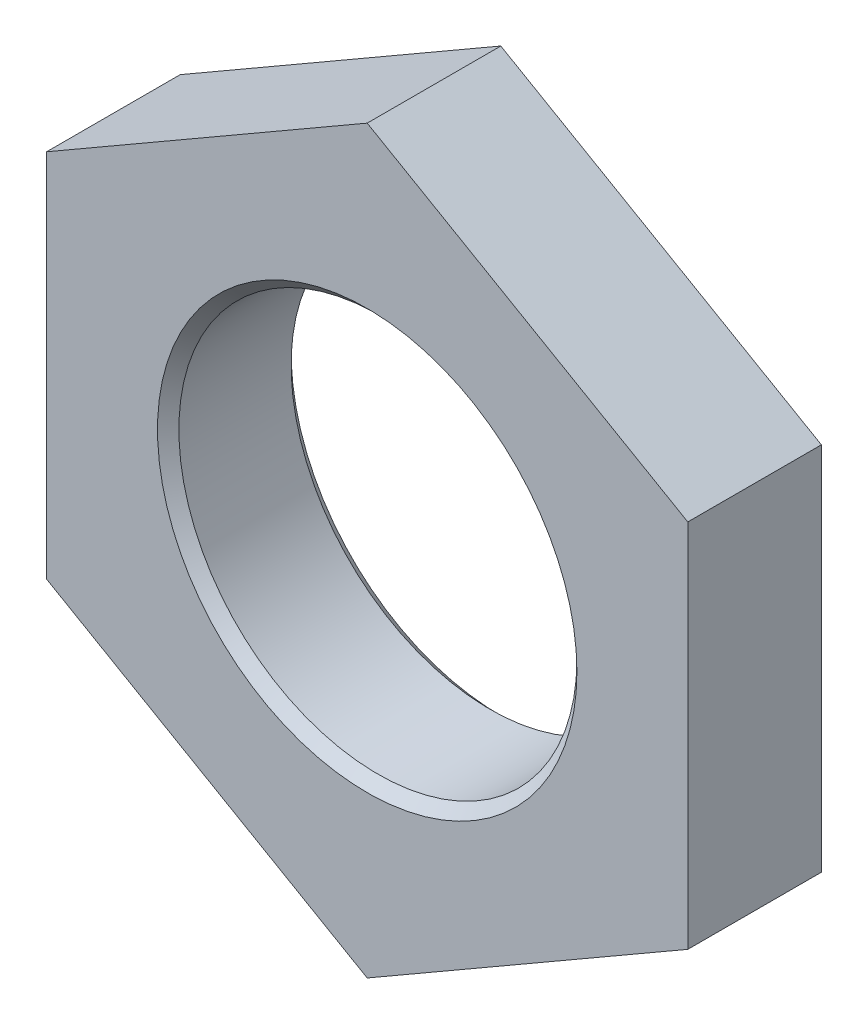
ISO-10303-21;
HEADER;
FILE_DESCRIPTION(('STEP AP214'),'2;1');
FILE_NAME('part.step','',(''),(''),'','','');
FILE_SCHEMA(('AUTOMOTIVE_DESIGN { 1 0 10303 214 1 1 1 1 }'));
ENDSEC;
DATA;
#1=APPLICATION_CONTEXT('core data for automotive mechanical design processes');
#2=APPLICATION_PROTOCOL_DEFINITION('international standard','automotive_design',2000,#1);
#3=PRODUCT_CONTEXT('',#1,'mechanical');
#4=PRODUCT('Part','Part','',(#3));
#5=PRODUCT_RELATED_PRODUCT_CATEGORY('part','',(#4));
#6=PRODUCT_DEFINITION_FORMATION('','',#4);
#7=PRODUCT_DEFINITION_CONTEXT('part definition',#1,'design');
#8=PRODUCT_DEFINITION('design','',#6,#7);
#9=PRODUCT_DEFINITION_SHAPE('','',#8);
#10=(LENGTH_UNIT() NAMED_UNIT(*) SI_UNIT(.MILLI.,.METRE.));
#11=(NAMED_UNIT(*) PLANE_ANGLE_UNIT() SI_UNIT($,.RADIAN.));
#12=(NAMED_UNIT(*) SI_UNIT($,.STERADIAN.) SOLID_ANGLE_UNIT());
#13=UNCERTAINTY_MEASURE_WITH_UNIT(LENGTH_MEASURE(1.E-05),#10,'distance_accuracy_value','');
#14=(GEOMETRIC_REPRESENTATION_CONTEXT(3) GLOBAL_UNCERTAINTY_ASSIGNED_CONTEXT((#13)) GLOBAL_UNIT_ASSIGNED_CONTEXT((#10,
#11,#12)) REPRESENTATION_CONTEXT('',''));
#15=CARTESIAN_POINT('',(0.,0.,0.));
#16=DIRECTION('',(0.,0.,1.));
#17=DIRECTION('',(1.,0.,0.));
#18=AXIS2_PLACEMENT_3D('',#15,#16,#17);
#19=CARTESIAN_POINT('',(6.,3.46410161513775,2.5));
#20=DIRECTION('',(-0.500000000000001,-0.866025403784438,0.));
#21=DIRECTION('',(0.866025403784438,-0.500000000000001,0.));
#22=AXIS2_PLACEMENT_3D('',#19,#20,#21);
#23=PLANE('',#22);
#24=DIRECTION('',(-0.866025403784438,0.500000000000001,0.));
#25=VECTOR('',#24,1.);
#26=CARTESIAN_POINT('',(6.,3.46410161513775,0.));
#27=LINE('',#26,#25);
#28=CARTESIAN_POINT('',(6.,3.46410161513775,0.));
#29=VERTEX_POINT('',#28);
#30=CARTESIAN_POINT('',(0.,6.92820323027551,0.));
#31=VERTEX_POINT('',#30);
#32=EDGE_CURVE('E134',#29,#31,#27,.T.);
#33=ORIENTED_EDGE('',*,*,#32,.T.);
#34=DIRECTION('',(0.,0.,-1.));
#35=VECTOR('',#34,1.);
#36=CARTESIAN_POINT('',(0.,6.92820323027551,2.5));
#37=LINE('',#36,#35);
#38=CARTESIAN_POINT('',(0.,6.92820323027551,2.5));
#39=VERTEX_POINT('',#38);
#40=EDGE_CURVE('E151',#39,#31,#37,.T.);
#41=ORIENTED_EDGE('',*,*,#40,.F.);
#42=DIRECTION('',(-0.866025403784438,0.500000000000001,0.));
#43=VECTOR('',#42,1.);
#44=CARTESIAN_POINT('',(6.,3.46410161513775,2.5));
#45=LINE('',#44,#43);
#46=CARTESIAN_POINT('',(6.,3.46410161513775,2.5));
#47=VERTEX_POINT('',#46);
#48=EDGE_CURVE('E144',#47,#39,#45,.T.);
#49=ORIENTED_EDGE('',*,*,#48,.F.);
#50=DIRECTION('',(0.,0.,-1.));
#51=VECTOR('',#50,1.);
#52=CARTESIAN_POINT('',(6.,3.46410161513775,2.5));
#53=LINE('',#52,#51);
#54=EDGE_CURVE('E130',#47,#29,#53,.T.);
#55=ORIENTED_EDGE('',*,*,#54,.T.);
#56=EDGE_LOOP('',(#33,#41,#49,#55));
#57=FACE_BOUND('',#56,.T.);
#58=ADVANCED_FACE('F47',(#57),#23,.F.);
#59=CARTESIAN_POINT('',(0.,6.92820323027551,2.5));
#60=DIRECTION('',(0.5,-0.866025403784439,0.));
#61=DIRECTION('',(0.866025403784439,0.5,0.));
#62=AXIS2_PLACEMENT_3D('',#59,#60,#61);
#63=PLANE('',#62);
#64=DIRECTION('',(-0.866025403784439,-0.499999999999999,0.));
#65=VECTOR('',#64,1.);
#66=CARTESIAN_POINT('',(0.,6.92820323027551,0.));
#67=LINE('',#66,#65);
#68=CARTESIAN_POINT('',(-6.,3.46410161513776,0.));
#69=VERTEX_POINT('',#68);
#70=EDGE_CURVE('E137',#31,#69,#67,.T.);
#71=ORIENTED_EDGE('',*,*,#70,.T.);
#72=DIRECTION('',(0.,0.,-1.));
#73=VECTOR('',#72,1.);
#74=CARTESIAN_POINT('',(-6.,3.46410161513776,2.5));
#75=LINE('',#74,#73);
#76=CARTESIAN_POINT('',(-6.,3.46410161513776,2.5));
#77=VERTEX_POINT('',#76);
#78=EDGE_CURVE('E148',#77,#69,#75,.T.);
#79=ORIENTED_EDGE('',*,*,#78,.F.);
#80=DIRECTION('',(-0.866025403784439,-0.499999999999999,0.));
#81=VECTOR('',#80,1.);
#82=CARTESIAN_POINT('',(0.,6.92820323027551,2.5));
#83=LINE('',#82,#81);
#84=EDGE_CURVE('E103',#39,#77,#83,.T.);
#85=ORIENTED_EDGE('',*,*,#84,.F.);
#86=ORIENTED_EDGE('',*,*,#40,.T.);
#87=EDGE_LOOP('',(#71,#79,#85,#86));
#88=FACE_BOUND('',#87,.T.);
#89=ADVANCED_FACE('F180',(#88),#63,.F.);
#90=CARTESIAN_POINT('',(-6.,3.46410161513776,2.5));
#91=DIRECTION('',(1.,0.,0.));
#92=DIRECTION('',(0.,1.,0.));
#93=AXIS2_PLACEMENT_3D('',#90,#91,#92);
#94=PLANE('',#93);
#95=DIRECTION('',(0.,-1.,0.));
#96=VECTOR('',#95,1.);
#97=CARTESIAN_POINT('',(-6.,3.46410161513776,0.));
#98=LINE('',#97,#96);
#99=CARTESIAN_POINT('',(-6.00000000000001,-3.46410161513775,0.));
#100=VERTEX_POINT('',#99);
#101=EDGE_CURVE('E139',#69,#100,#98,.T.);
#102=ORIENTED_EDGE('',*,*,#101,.T.);
#103=DIRECTION('',(0.,0.,-1.));
#104=VECTOR('',#103,1.);
#105=CARTESIAN_POINT('',(-6.00000000000001,-3.46410161513775,2.5));
#106=LINE('',#105,#104);
#107=CARTESIAN_POINT('',(-6.00000000000001,-3.46410161513775,2.5));
#108=VERTEX_POINT('',#107);
#109=EDGE_CURVE('E125',#108,#100,#106,.T.);
#110=ORIENTED_EDGE('',*,*,#109,.F.);
#111=DIRECTION('',(0.,-1.,0.));
#112=VECTOR('',#111,1.);
#113=CARTESIAN_POINT('',(-6.,3.46410161513776,2.5));
#114=LINE('',#113,#112);
#115=EDGE_CURVE('E116',#77,#108,#114,.T.);
#116=ORIENTED_EDGE('',*,*,#115,.F.);
#117=ORIENTED_EDGE('',*,*,#78,.T.);
#118=EDGE_LOOP('',(#102,#110,#116,#117));
#119=FACE_BOUND('',#118,.T.);
#120=ADVANCED_FACE('F186',(#119),#94,.F.);
#121=CARTESIAN_POINT('',(-6.00000000000001,-3.46410161513775,2.5));
#122=DIRECTION('',(0.500000000000001,0.866025403784438,0.));
#123=DIRECTION('',(-0.866025403784438,0.500000000000001,0.));
#124=AXIS2_PLACEMENT_3D('',#121,#122,#123);
#125=PLANE('',#124);
#126=DIRECTION('',(0.866025403784438,-0.500000000000001,0.));
#127=VECTOR('',#126,1.);
#128=CARTESIAN_POINT('',(-6.00000000000001,-3.46410161513775,0.));
#129=LINE('',#128,#127);
#130=CARTESIAN_POINT('',(0.,-6.92820323027551,0.));
#131=VERTEX_POINT('',#130);
#132=EDGE_CURVE('E124',#100,#131,#129,.T.);
#133=ORIENTED_EDGE('',*,*,#132,.T.);
#134=DIRECTION('',(0.,0.,-1.));
#135=VECTOR('',#134,1.);
#136=CARTESIAN_POINT('',(0.,-6.92820323027551,2.5));
#137=LINE('',#136,#135);
#138=CARTESIAN_POINT('',(0.,-6.92820323027551,2.5));
#139=VERTEX_POINT('',#138);
#140=EDGE_CURVE('E121',#139,#131,#137,.T.);
#141=ORIENTED_EDGE('',*,*,#140,.F.);
#142=DIRECTION('',(0.866025403784438,-0.500000000000001,0.));
#143=VECTOR('',#142,1.);
#144=CARTESIAN_POINT('',(-6.00000000000001,-3.46410161513775,2.5));
#145=LINE('',#144,#143);
#146=EDGE_CURVE('E110',#108,#139,#145,.T.);
#147=ORIENTED_EDGE('',*,*,#146,.F.);
#148=ORIENTED_EDGE('',*,*,#109,.T.);
#149=EDGE_LOOP('',(#133,#141,#147,#148));
#150=FACE_BOUND('',#149,.T.);
#151=ADVANCED_FACE('F122',(#150),#125,.F.);
#152=CARTESIAN_POINT('',(0.,-6.92820323027551,2.5));
#153=DIRECTION('',(-0.5,0.866025403784439,0.));
#154=DIRECTION('',(-0.866025403784439,-0.5,0.));
#155=AXIS2_PLACEMENT_3D('',#152,#153,#154);
#156=PLANE('',#155);
#157=DIRECTION('',(0.866025403784439,0.5,0.));
#158=VECTOR('',#157,1.);
#159=CARTESIAN_POINT('',(0.,-6.92820323027551,0.));
#160=LINE('',#159,#158);
#161=CARTESIAN_POINT('',(6.,-3.46410161513777,0.));
#162=VERTEX_POINT('',#161);
#163=EDGE_CURVE('E88',#131,#162,#160,.T.);
#164=ORIENTED_EDGE('',*,*,#163,.T.);
#165=DIRECTION('',(0.,0.,-1.));
#166=VECTOR('',#165,1.);
#167=CARTESIAN_POINT('',(6.,-3.46410161513777,2.5));
#168=LINE('',#167,#166);
#169=CARTESIAN_POINT('',(6.,-3.46410161513777,2.5));
#170=VERTEX_POINT('',#169);
#171=EDGE_CURVE('E126',#170,#162,#168,.T.);
#172=ORIENTED_EDGE('',*,*,#171,.F.);
#173=DIRECTION('',(0.866025403784439,0.5,0.));
#174=VECTOR('',#173,1.);
#175=CARTESIAN_POINT('',(0.,-6.92820323027551,2.5));
#176=LINE('',#175,#174);
#177=EDGE_CURVE('E114',#139,#170,#176,.T.);
#178=ORIENTED_EDGE('',*,*,#177,.F.);
#179=ORIENTED_EDGE('',*,*,#140,.T.);
#180=EDGE_LOOP('',(#164,#172,#178,#179));
#181=FACE_BOUND('',#180,.T.);
#182=ADVANCED_FACE('F128',(#181),#156,.F.);
#183=CARTESIAN_POINT('',(6.,-3.46410161513777,2.5));
#184=DIRECTION('',(-1.,0.,0.));
#185=DIRECTION('',(0.,-1.,0.));
#186=AXIS2_PLACEMENT_3D('',#183,#184,#185);
#187=PLANE('',#186);
#188=DIRECTION('',(0.,1.,0.));
#189=VECTOR('',#188,1.);
#190=CARTESIAN_POINT('',(6.,-3.46410161513777,0.));
#191=LINE('',#190,#189);
#192=EDGE_CURVE('E94',#162,#29,#191,.T.);
#193=ORIENTED_EDGE('',*,*,#192,.T.);
#194=ORIENTED_EDGE('',*,*,#54,.F.);
#195=DIRECTION('',(0.,1.,0.));
#196=VECTOR('',#195,1.);
#197=CARTESIAN_POINT('',(6.,-3.46410161513777,2.5));
#198=LINE('',#197,#196);
#199=EDGE_CURVE('E65',#170,#47,#198,.T.);
#200=ORIENTED_EDGE('',*,*,#199,.F.);
#201=ORIENTED_EDGE('',*,*,#171,.T.);
#202=EDGE_LOOP('',(#193,#194,#200,#201));
#203=FACE_BOUND('',#202,.T.);
#204=ADVANCED_FACE('F201',(#203),#187,.F.);
#205=CARTESIAN_POINT('',(0.,0.,2.5));
#206=DIRECTION('',(0.,0.,1.));
#207=DIRECTION('',(1.,0.,0.));
#208=AXIS2_PLACEMENT_3D('',#205,#206,#207);
#209=PLANE('',#208);
#210=CARTESIAN_POINT('',(0.,0.,2.5));
#211=DIRECTION('',(0.,0.,1.));
#212=DIRECTION('',(1.,0.,0.));
#213=AXIS2_PLACEMENT_3D('',#210,#211,#212);
#214=CIRCLE('',#213,3.92495696314199);
#215=CARTESIAN_POINT('',(3.92495696314199,0.,2.5));
#216=VERTEX_POINT('',#215);
#217=EDGE_CURVE('E57',#216,#216,#214,.F.);
#218=ORIENTED_EDGE('',*,*,#217,.T.);
#219=EDGE_LOOP('',(#218));
#220=FACE_BOUND('',#219,.T.);
#221=ORIENTED_EDGE('',*,*,#48,.T.);
#222=ORIENTED_EDGE('',*,*,#84,.T.);
#223=ORIENTED_EDGE('',*,*,#115,.T.);
#224=ORIENTED_EDGE('',*,*,#146,.T.);
#225=ORIENTED_EDGE('',*,*,#177,.T.);
#226=ORIENTED_EDGE('',*,*,#199,.T.);
#227=EDGE_LOOP('',(#221,#222,#223,#224,#225,#226));
#228=FACE_BOUND('',#227,.T.);
#229=ADVANCED_FACE('F112',(#220,#228),#209,.T.);
#230=CARTESIAN_POINT('',(0.,0.,0.));
#231=DIRECTION('',(0.,0.,1.));
#232=DIRECTION('',(1.,0.,0.));
#233=AXIS2_PLACEMENT_3D('',#230,#231,#232);
#234=PLANE('',#233);
#235=CARTESIAN_POINT('',(0.,0.,0.));
#236=DIRECTION('',(0.,0.,1.));
#237=DIRECTION('',(1.,0.,0.));
#238=AXIS2_PLACEMENT_3D('',#235,#236,#237);
#239=CIRCLE('',#238,3.92495696314198);
#240=CARTESIAN_POINT('',(3.92495696314198,0.,0.));
#241=VERTEX_POINT('',#240);
#242=EDGE_CURVE('E11',#241,#241,#239,.T.);
#243=ORIENTED_EDGE('',*,*,#242,.T.);
#244=EDGE_LOOP('',(#243));
#245=FACE_BOUND('',#244,.T.);
#246=ORIENTED_EDGE('',*,*,#32,.F.);
#247=ORIENTED_EDGE('',*,*,#192,.F.);
#248=ORIENTED_EDGE('',*,*,#163,.F.);
#249=ORIENTED_EDGE('',*,*,#132,.F.);
#250=ORIENTED_EDGE('',*,*,#101,.F.);
#251=ORIENTED_EDGE('',*,*,#70,.F.);
#252=EDGE_LOOP('',(#246,#247,#248,#249,#250,#251));
#253=FACE_BOUND('',#252,.T.);
#254=ADVANCED_FACE('F170',(#245,#253),#234,.F.);
#255=CARTESIAN_POINT('',(0.,0.,6.5));
#256=DIRECTION('',(0.,0.,-1.));
#257=DIRECTION('',(-1.,0.,0.));
#258=AXIS2_PLACEMENT_3D('',#255,#256,#257);
#259=CYLINDRICAL_SURFACE('',#258,3.72495696314199);
#260=CARTESIAN_POINT('',(0.,0.,2.3));
#261=DIRECTION('',(0.,0.,1.));
#262=DIRECTION('',(1.,0.,0.));
#263=AXIS2_PLACEMENT_3D('',#260,#261,#262);
#264=CIRCLE('',#263,3.72495696314199);
#265=CARTESIAN_POINT('',(3.72495696314199,0.,2.3));
#266=VERTEX_POINT('',#265);
#267=EDGE_CURVE('E156',#266,#266,#264,.T.);
#268=ORIENTED_EDGE('',*,*,#267,.T.);
#269=EDGE_LOOP('',(#268));
#270=FACE_BOUND('',#269,.T.);
#271=CARTESIAN_POINT('',(0.,0.,0.199999999999998));
#272=DIRECTION('',(0.,0.,1.));
#273=DIRECTION('',(1.,0.,0.));
#274=AXIS2_PLACEMENT_3D('',#271,#272,#273);
#275=CIRCLE('',#274,3.72495696314199);
#276=CARTESIAN_POINT('',(3.72495696314199,0.,0.199999999999998));
#277=VERTEX_POINT('',#276);
#278=EDGE_CURVE('E153',#277,#277,#275,.F.);
#279=ORIENTED_EDGE('',*,*,#278,.T.);
#280=EDGE_LOOP('',(#279));
#281=FACE_BOUND('',#280,.T.);
#282=ADVANCED_FACE('F165',(#270,#281),#259,.F.);
#283=CARTESIAN_POINT('',(0.,0.,2.3));
#284=DIRECTION('',(0.,0.,1.));
#285=DIRECTION('',(1.,0.,0.));
#286=AXIS2_PLACEMENT_3D('',#283,#284,#285);
#287=CONICAL_SURFACE('',#286,3.72495696314199,0.78539816339745);
#288=ORIENTED_EDGE('',*,*,#217,.F.);
#289=EDGE_LOOP('',(#288));
#290=FACE_BOUND('',#289,.T.);
#291=ORIENTED_EDGE('',*,*,#267,.F.);
#292=EDGE_LOOP('',(#291));
#293=FACE_BOUND('',#292,.T.);
#294=ADVANCED_FACE('F162',(#290,#293),#287,.F.);
#295=CARTESIAN_POINT('',(0.,0.,0.199999999999998));
#296=DIRECTION('',(0.,0.,-1.));
#297=DIRECTION('',(-1.,0.,0.));
#298=AXIS2_PLACEMENT_3D('',#295,#296,#297);
#299=CONICAL_SURFACE('',#298,3.72495696314199,0.785398163397446);
#300=ORIENTED_EDGE('',*,*,#242,.F.);
#301=EDGE_LOOP('',(#300));
#302=FACE_BOUND('',#301,.T.);
#303=ORIENTED_EDGE('',*,*,#278,.F.);
#304=EDGE_LOOP('',(#303));
#305=FACE_BOUND('',#304,.T.);
#306=ADVANCED_FACE('F50',(#302,#305),#299,.F.);
#307=CLOSED_SHELL('',(#58,#89,#120,#151,#182,#204,#229,#254,#282,#294,#306));
#308=MANIFOLD_SOLID_BREP('B2',#307);
#309=ADVANCED_BREP_SHAPE_REPRESENTATION('',(#18,#308),#14);
#310=SHAPE_DEFINITION_REPRESENTATION(#9,#309);
ENDSEC;
END-ISO-10303-21;
